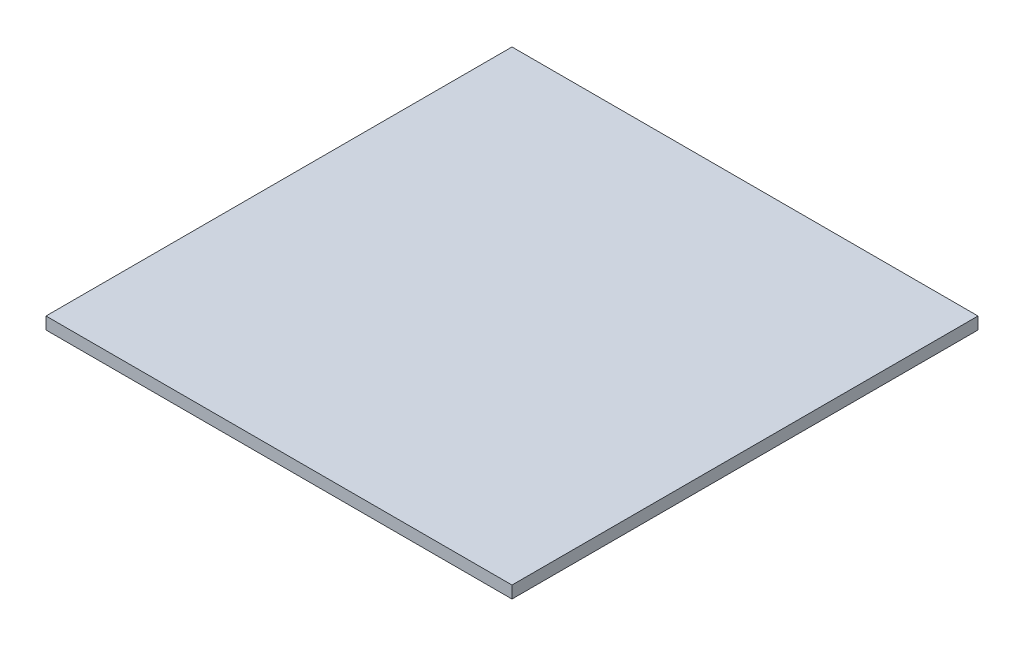
ISO-10303-21;
HEADER;
FILE_DESCRIPTION(('STEP AP214'),'2;1');
FILE_NAME('part.step','',(''),(''),'','','');
FILE_SCHEMA(('AUTOMOTIVE_DESIGN { 1 0 10303 214 1 1 1 1 }'));
ENDSEC;
DATA;
#1=APPLICATION_CONTEXT('core data for automotive mechanical design processes');
#2=APPLICATION_PROTOCOL_DEFINITION('international standard','automotive_design',2000,#1);
#3=PRODUCT_CONTEXT('',#1,'mechanical');
#4=PRODUCT('Part','Part','',(#3));
#5=PRODUCT_RELATED_PRODUCT_CATEGORY('part','',(#4));
#6=PRODUCT_DEFINITION_FORMATION('','',#4);
#7=PRODUCT_DEFINITION_CONTEXT('part definition',#1,'design');
#8=PRODUCT_DEFINITION('design','',#6,#7);
#9=PRODUCT_DEFINITION_SHAPE('','',#8);
#10=(LENGTH_UNIT() NAMED_UNIT(*) SI_UNIT(.MILLI.,.METRE.));
#11=(NAMED_UNIT(*) PLANE_ANGLE_UNIT() SI_UNIT($,.RADIAN.));
#12=(NAMED_UNIT(*) SI_UNIT($,.STERADIAN.) SOLID_ANGLE_UNIT());
#13=UNCERTAINTY_MEASURE_WITH_UNIT(LENGTH_MEASURE(1.E-05),#10,'distance_accuracy_value','');
#14=(GEOMETRIC_REPRESENTATION_CONTEXT(3) GLOBAL_UNCERTAINTY_ASSIGNED_CONTEXT((#13)) GLOBAL_UNIT_ASSIGNED_CONTEXT((#10,
#11,#12)) REPRESENTATION_CONTEXT('',''));
#15=CARTESIAN_POINT('',(0.,0.,0.));
#16=DIRECTION('',(0.,0.,1.));
#17=DIRECTION('',(1.,0.,0.));
#18=AXIS2_PLACEMENT_3D('',#15,#16,#17);
#19=CARTESIAN_POINT('',(0.,0.,0.));
#20=DIRECTION('',(0.,1.,0.));
#21=DIRECTION('',(0.,0.,1.));
#22=AXIS2_PLACEMENT_3D('',#19,#20,#21);
#23=PLANE('',#22);
#24=DIRECTION('',(0.,0.,-1.));
#25=VECTOR('',#24,1.);
#26=CARTESIAN_POINT('',(345.,0.,345.));
#27=LINE('',#26,#25);
#28=CARTESIAN_POINT('',(345.,0.,345.));
#29=VERTEX_POINT('',#28);
#30=CARTESIAN_POINT('',(345.,0.,-345.));
#31=VERTEX_POINT('',#30);
#32=EDGE_CURVE('E79',#29,#31,#27,.T.);
#33=ORIENTED_EDGE('',*,*,#32,.F.);
#34=DIRECTION('',(1.,0.,0.));
#35=VECTOR('',#34,1.);
#36=CARTESIAN_POINT('',(-345.,0.,345.));
#37=LINE('',#36,#35);
#38=CARTESIAN_POINT('',(-345.,0.,345.));
#39=VERTEX_POINT('',#38);
#40=EDGE_CURVE('E55',#39,#29,#37,.T.);
#41=ORIENTED_EDGE('',*,*,#40,.F.);
#42=DIRECTION('',(0.,0.,1.));
#43=VECTOR('',#42,1.);
#44=CARTESIAN_POINT('',(-345.,0.,-345.));
#45=LINE('',#44,#43);
#46=CARTESIAN_POINT('',(-345.,0.,-345.));
#47=VERTEX_POINT('',#46);
#48=EDGE_CURVE('E57',#47,#39,#45,.T.);
#49=ORIENTED_EDGE('',*,*,#48,.F.);
#50=DIRECTION('',(-1.,0.,0.));
#51=VECTOR('',#50,1.);
#52=CARTESIAN_POINT('',(345.,0.,-345.));
#53=LINE('',#52,#51);
#54=EDGE_CURVE('E20',#31,#47,#53,.T.);
#55=ORIENTED_EDGE('',*,*,#54,.F.);
#56=EDGE_LOOP('',(#33,#41,#49,#55));
#57=FACE_BOUND('',#56,.T.);
#58=ADVANCED_FACE('F17',(#57),#23,.F.);
#59=CARTESIAN_POINT('',(345.,0.,-345.));
#60=DIRECTION('',(0.,0.,-1.));
#61=DIRECTION('',(-1.,0.,0.));
#62=AXIS2_PLACEMENT_3D('',#59,#60,#61);
#63=PLANE('',#62);
#64=DIRECTION('',(1.,0.,0.));
#65=VECTOR('',#64,1.);
#66=CARTESIAN_POINT('',(0.,18.,-345.));
#67=LINE('',#66,#65);
#68=CARTESIAN_POINT('',(345.,18.,-345.));
#69=VERTEX_POINT('',#68);
#70=CARTESIAN_POINT('',(-345.,18.,-345.));
#71=VERTEX_POINT('',#70);
#72=EDGE_CURVE('E83',#69,#71,#67,.F.);
#73=ORIENTED_EDGE('',*,*,#72,.F.);
#74=DIRECTION('',(0.,1.,0.));
#75=VECTOR('',#74,1.);
#76=CARTESIAN_POINT('',(345.,0.,-345.));
#77=LINE('',#76,#75);
#78=EDGE_CURVE('E68',#31,#69,#77,.T.);
#79=ORIENTED_EDGE('',*,*,#78,.F.);
#80=ORIENTED_EDGE('',*,*,#54,.T.);
#81=DIRECTION('',(0.,1.,0.));
#82=VECTOR('',#81,1.);
#83=CARTESIAN_POINT('',(-345.,0.,-345.));
#84=LINE('',#83,#82);
#85=EDGE_CURVE('E63',#71,#47,#84,.F.);
#86=ORIENTED_EDGE('',*,*,#85,.F.);
#87=EDGE_LOOP('',(#73,#79,#80,#86));
#88=FACE_BOUND('',#87,.T.);
#89=ADVANCED_FACE('F65',(#88),#63,.T.);
#90=CARTESIAN_POINT('',(-345.,0.,-345.));
#91=DIRECTION('',(-1.,0.,0.));
#92=DIRECTION('',(0.,0.,1.));
#93=AXIS2_PLACEMENT_3D('',#90,#91,#92);
#94=PLANE('',#93);
#95=DIRECTION('',(0.,0.,1.));
#96=VECTOR('',#95,1.);
#97=CARTESIAN_POINT('',(-345.,18.,0.));
#98=LINE('',#97,#96);
#99=CARTESIAN_POINT('',(-345.,18.,345.));
#100=VERTEX_POINT('',#99);
#101=EDGE_CURVE('E72',#71,#100,#98,.T.);
#102=ORIENTED_EDGE('',*,*,#101,.F.);
#103=ORIENTED_EDGE('',*,*,#85,.T.);
#104=ORIENTED_EDGE('',*,*,#48,.T.);
#105=DIRECTION('',(0.,1.,0.));
#106=VECTOR('',#105,1.);
#107=CARTESIAN_POINT('',(-345.,0.,345.));
#108=LINE('',#107,#106);
#109=EDGE_CURVE('E75',#100,#39,#108,.F.);
#110=ORIENTED_EDGE('',*,*,#109,.F.);
#111=EDGE_LOOP('',(#102,#103,#104,#110));
#112=FACE_BOUND('',#111,.T.);
#113=ADVANCED_FACE('F70',(#112),#94,.T.);
#114=CARTESIAN_POINT('',(-345.,0.,345.));
#115=DIRECTION('',(0.,0.,1.));
#116=DIRECTION('',(1.,0.,0.));
#117=AXIS2_PLACEMENT_3D('',#114,#115,#116);
#118=PLANE('',#117);
#119=DIRECTION('',(1.,0.,0.));
#120=VECTOR('',#119,1.);
#121=CARTESIAN_POINT('',(0.,18.,345.));
#122=LINE('',#121,#120);
#123=CARTESIAN_POINT('',(345.,18.,345.));
#124=VERTEX_POINT('',#123);
#125=EDGE_CURVE('E26',#100,#124,#122,.T.);
#126=ORIENTED_EDGE('',*,*,#125,.F.);
#127=ORIENTED_EDGE('',*,*,#109,.T.);
#128=ORIENTED_EDGE('',*,*,#40,.T.);
#129=DIRECTION('',(0.,1.,0.));
#130=VECTOR('',#129,1.);
#131=CARTESIAN_POINT('',(345.,0.,345.));
#132=LINE('',#131,#130);
#133=EDGE_CURVE('E35',#124,#29,#132,.F.);
#134=ORIENTED_EDGE('',*,*,#133,.F.);
#135=EDGE_LOOP('',(#126,#127,#128,#134));
#136=FACE_BOUND('',#135,.T.);
#137=ADVANCED_FACE('F89',(#136),#118,.T.);
#138=CARTESIAN_POINT('',(345.,0.,345.));
#139=DIRECTION('',(1.,0.,0.));
#140=DIRECTION('',(0.,0.,-1.));
#141=AXIS2_PLACEMENT_3D('',#138,#139,#140);
#142=PLANE('',#141);
#143=DIRECTION('',(0.,0.,1.));
#144=VECTOR('',#143,1.);
#145=CARTESIAN_POINT('',(345.,18.,0.));
#146=LINE('',#145,#144);
#147=EDGE_CURVE('E11',#124,#69,#146,.F.);
#148=ORIENTED_EDGE('',*,*,#147,.F.);
#149=ORIENTED_EDGE('',*,*,#133,.T.);
#150=ORIENTED_EDGE('',*,*,#32,.T.);
#151=ORIENTED_EDGE('',*,*,#78,.T.);
#152=EDGE_LOOP('',(#148,#149,#150,#151));
#153=FACE_BOUND('',#152,.T.);
#154=ADVANCED_FACE('F91',(#153),#142,.T.);
#155=CARTESIAN_POINT('',(0.,18.,0.));
#156=DIRECTION('',(0.,1.,0.));
#157=DIRECTION('',(0.,0.,1.));
#158=AXIS2_PLACEMENT_3D('',#155,#156,#157);
#159=PLANE('',#158);
#160=ORIENTED_EDGE('',*,*,#125,.T.);
#161=ORIENTED_EDGE('',*,*,#147,.T.);
#162=ORIENTED_EDGE('',*,*,#72,.T.);
#163=ORIENTED_EDGE('',*,*,#101,.T.);
#164=EDGE_LOOP('',(#160,#161,#162,#163));
#165=FACE_BOUND('',#164,.T.);
#166=ADVANCED_FACE('F88',(#165),#159,.T.);
#167=CLOSED_SHELL('',(#58,#89,#113,#137,#154,#166));
#168=MANIFOLD_SOLID_BREP('B1',#167);
#169=ADVANCED_BREP_SHAPE_REPRESENTATION('',(#18,#168),#14);
#170=SHAPE_DEFINITION_REPRESENTATION(#9,#169);
ENDSEC;
END-ISO-10303-21;
